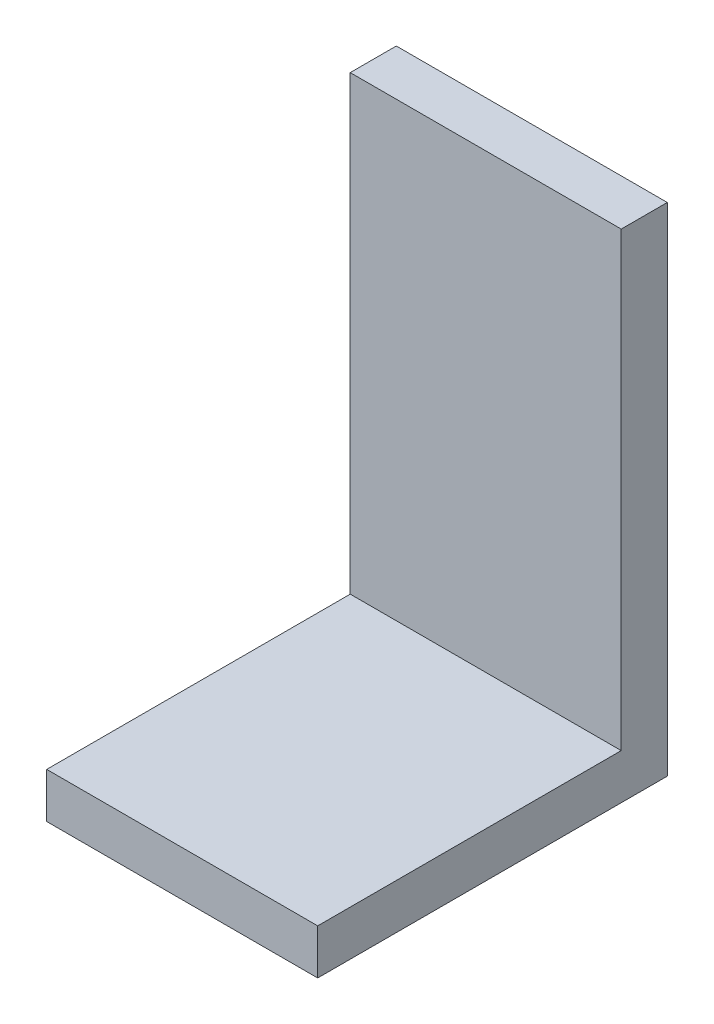
ISO-10303-21;
HEADER;
FILE_DESCRIPTION(('STEP AP214'),'2;1');
FILE_NAME('part.step','',(''),(''),'','','');
FILE_SCHEMA(('AUTOMOTIVE_DESIGN { 1 0 10303 214 1 1 1 1 }'));
ENDSEC;
DATA;
#1=APPLICATION_CONTEXT('core data for automotive mechanical design processes');
#2=APPLICATION_PROTOCOL_DEFINITION('international standard','automotive_design',2000,#1);
#3=PRODUCT_CONTEXT('',#1,'mechanical');
#4=PRODUCT('Part','Part','',(#3));
#5=PRODUCT_RELATED_PRODUCT_CATEGORY('part','',(#4));
#6=PRODUCT_DEFINITION_FORMATION('','',#4);
#7=PRODUCT_DEFINITION_CONTEXT('part definition',#1,'design');
#8=PRODUCT_DEFINITION('design','',#6,#7);
#9=PRODUCT_DEFINITION_SHAPE('','',#8);
#10=(LENGTH_UNIT() NAMED_UNIT(*) SI_UNIT(.MILLI.,.METRE.));
#11=(NAMED_UNIT(*) PLANE_ANGLE_UNIT() SI_UNIT($,.RADIAN.));
#12=(NAMED_UNIT(*) SI_UNIT($,.STERADIAN.) SOLID_ANGLE_UNIT());
#13=UNCERTAINTY_MEASURE_WITH_UNIT(LENGTH_MEASURE(1.E-05),#10,'distance_accuracy_value','');
#14=(GEOMETRIC_REPRESENTATION_CONTEXT(3) GLOBAL_UNCERTAINTY_ASSIGNED_CONTEXT((#13)) GLOBAL_UNIT_ASSIGNED_CONTEXT((#10,
#11,#12)) REPRESENTATION_CONTEXT('',''));
#15=CARTESIAN_POINT('',(0.,0.,0.));
#16=DIRECTION('',(0.,0.,1.));
#17=DIRECTION('',(1.,0.,0.));
#18=AXIS2_PLACEMENT_3D('',#15,#16,#17);
#19=CARTESIAN_POINT('',(-2.1,-4.55,0.));
#20=DIRECTION('',(1.,0.,0.));
#21=DIRECTION('',(0.,0.,1.));
#22=AXIS2_PLACEMENT_3D('',#19,#20,#21);
#23=PLANE('',#22);
#24=DIRECTION('',(0.,-1.,0.));
#25=VECTOR('',#24,1.);
#26=CARTESIAN_POINT('',(-2.1,-4.,0.));
#27=LINE('',#26,#25);
#28=CARTESIAN_POINT('',(-2.1,-4.,0.));
#29=VERTEX_POINT('',#28);
#30=CARTESIAN_POINT('',(-2.1,-4.55,0.));
#31=VERTEX_POINT('',#30);
#32=EDGE_CURVE('E11',#29,#31,#27,.T.);
#33=ORIENTED_EDGE('',*,*,#32,.F.);
#34=DIRECTION('',(0.,0.,-1.));
#35=VECTOR('',#34,1.);
#36=CARTESIAN_POINT('',(-2.1,-4.,0.051));
#37=LINE('',#36,#35);
#38=CARTESIAN_POINT('',(-2.1,-4.,0.051));
#39=VERTEX_POINT('',#38);
#40=EDGE_CURVE('E24',#39,#29,#37,.T.);
#41=ORIENTED_EDGE('',*,*,#40,.F.);
#42=DIRECTION('',(0.,1.,0.));
#43=VECTOR('',#42,1.);
#44=CARTESIAN_POINT('',(-2.1,-4.5,0.051));
#45=LINE('',#44,#43);
#46=CARTESIAN_POINT('',(-2.1,-4.5,0.051));
#47=VERTEX_POINT('',#46);
#48=EDGE_CURVE('E87',#47,#39,#45,.T.);
#49=ORIENTED_EDGE('',*,*,#48,.F.);
#50=DIRECTION('',(0.,0.,-1.));
#51=VECTOR('',#50,1.);
#52=CARTESIAN_POINT('',(-2.1,-4.5,0.387));
#53=LINE('',#52,#51);
#54=CARTESIAN_POINT('',(-2.1,-4.5,0.387));
#55=VERTEX_POINT('',#54);
#56=EDGE_CURVE('E114',#55,#47,#53,.T.);
#57=ORIENTED_EDGE('',*,*,#56,.F.);
#58=DIRECTION('',(0.,1.,0.));
#59=VECTOR('',#58,1.);
#60=CARTESIAN_POINT('',(-2.1,-4.55,0.387));
#61=LINE('',#60,#59);
#62=CARTESIAN_POINT('',(-2.1,-4.55,0.387));
#63=VERTEX_POINT('',#62);
#64=EDGE_CURVE('E111',#63,#55,#61,.T.);
#65=ORIENTED_EDGE('',*,*,#64,.F.);
#66=DIRECTION('',(0.,0.,1.));
#67=VECTOR('',#66,1.);
#68=CARTESIAN_POINT('',(-2.1,-4.55,0.));
#69=LINE('',#68,#67);
#70=EDGE_CURVE('E108',#31,#63,#69,.T.);
#71=ORIENTED_EDGE('',*,*,#70,.F.);
#72=EDGE_LOOP('',(#33,#41,#49,#57,#65,#71));
#73=FACE_BOUND('',#72,.T.);
#74=ADVANCED_FACE('F17',(#73),#23,.T.);
#75=CARTESIAN_POINT('',(-2.4,-4.,0.));
#76=DIRECTION('',(-1.,0.,0.));
#77=DIRECTION('',(0.,0.,1.));
#78=AXIS2_PLACEMENT_3D('',#75,#76,#77);
#79=PLANE('',#78);
#80=DIRECTION('',(0.,1.,0.));
#81=VECTOR('',#80,1.);
#82=CARTESIAN_POINT('',(-2.4,-4.55,0.));
#83=LINE('',#82,#81);
#84=CARTESIAN_POINT('',(-2.4,-4.55,0.));
#85=VERTEX_POINT('',#84);
#86=CARTESIAN_POINT('',(-2.4,-4.,0.));
#87=VERTEX_POINT('',#86);
#88=EDGE_CURVE('E106',#85,#87,#83,.T.);
#89=ORIENTED_EDGE('',*,*,#88,.F.);
#90=DIRECTION('',(0.,0.,-1.));
#91=VECTOR('',#90,1.);
#92=CARTESIAN_POINT('',(-2.4,-4.55,0.387));
#93=LINE('',#92,#91);
#94=CARTESIAN_POINT('',(-2.4,-4.55,0.387));
#95=VERTEX_POINT('',#94);
#96=EDGE_CURVE('E103',#95,#85,#93,.T.);
#97=ORIENTED_EDGE('',*,*,#96,.F.);
#98=DIRECTION('',(0.,-1.,0.));
#99=VECTOR('',#98,1.);
#100=CARTESIAN_POINT('',(-2.4,-4.5,0.387));
#101=LINE('',#100,#99);
#102=CARTESIAN_POINT('',(-2.4,-4.5,0.387));
#103=VERTEX_POINT('',#102);
#104=EDGE_CURVE('E100',#103,#95,#101,.T.);
#105=ORIENTED_EDGE('',*,*,#104,.F.);
#106=DIRECTION('',(0.,0.,1.));
#107=VECTOR('',#106,1.);
#108=CARTESIAN_POINT('',(-2.4,-4.5,0.051));
#109=LINE('',#108,#107);
#110=CARTESIAN_POINT('',(-2.4,-4.5,0.051));
#111=VERTEX_POINT('',#110);
#112=EDGE_CURVE('E72',#111,#103,#109,.T.);
#113=ORIENTED_EDGE('',*,*,#112,.F.);
#114=DIRECTION('',(0.,-1.,0.));
#115=VECTOR('',#114,1.);
#116=CARTESIAN_POINT('',(-2.4,-4.,0.051));
#117=LINE('',#116,#115);
#118=CARTESIAN_POINT('',(-2.4,-4.,0.051));
#119=VERTEX_POINT('',#118);
#120=EDGE_CURVE('E66',#119,#111,#117,.T.);
#121=ORIENTED_EDGE('',*,*,#120,.F.);
#122=DIRECTION('',(0.,0.,1.));
#123=VECTOR('',#122,1.);
#124=CARTESIAN_POINT('',(-2.4,-4.,0.));
#125=LINE('',#124,#123);
#126=EDGE_CURVE('E69',#87,#119,#125,.T.);
#127=ORIENTED_EDGE('',*,*,#126,.F.);
#128=EDGE_LOOP('',(#89,#97,#105,#113,#121,#127));
#129=FACE_BOUND('',#128,.T.);
#130=ADVANCED_FACE('F68',(#129),#79,.T.);
#131=CARTESIAN_POINT('',(-2.1,-4.55,0.387));
#132=DIRECTION('',(0.,0.,1.));
#133=DIRECTION('',(0.,1.,0.));
#134=AXIS2_PLACEMENT_3D('',#131,#132,#133);
#135=PLANE('',#134);
#136=ORIENTED_EDGE('',*,*,#64,.T.);
#137=DIRECTION('',(1.,0.,0.));
#138=VECTOR('',#137,1.);
#139=CARTESIAN_POINT('',(-2.4,-4.5,0.387));
#140=LINE('',#139,#138);
#141=EDGE_CURVE('E83',#103,#55,#140,.T.);
#142=ORIENTED_EDGE('',*,*,#141,.F.);
#143=ORIENTED_EDGE('',*,*,#104,.T.);
#144=DIRECTION('',(-1.,0.,0.));
#145=VECTOR('',#144,1.);
#146=CARTESIAN_POINT('',(-2.1,-4.55,0.387));
#147=LINE('',#146,#145);
#148=EDGE_CURVE('E88',#63,#95,#147,.T.);
#149=ORIENTED_EDGE('',*,*,#148,.F.);
#150=EDGE_LOOP('',(#136,#142,#143,#149));
#151=FACE_BOUND('',#150,.T.);
#152=ADVANCED_FACE('F125',(#151),#135,.T.);
#153=CARTESIAN_POINT('',(-2.1,-4.5,0.051));
#154=DIRECTION('',(0.,0.,1.));
#155=DIRECTION('',(0.,1.,0.));
#156=AXIS2_PLACEMENT_3D('',#153,#154,#155);
#157=PLANE('',#156);
#158=ORIENTED_EDGE('',*,*,#48,.T.);
#159=DIRECTION('',(1.,0.,0.));
#160=VECTOR('',#159,1.);
#161=CARTESIAN_POINT('',(-2.4,-4.,0.051));
#162=LINE('',#161,#160);
#163=EDGE_CURVE('E81',#119,#39,#162,.T.);
#164=ORIENTED_EDGE('',*,*,#163,.F.);
#165=ORIENTED_EDGE('',*,*,#120,.T.);
#166=DIRECTION('',(-1.,0.,0.));
#167=VECTOR('',#166,1.);
#168=CARTESIAN_POINT('',(-2.1,-4.5,0.051));
#169=LINE('',#168,#167);
#170=EDGE_CURVE('E89',#47,#111,#169,.T.);
#171=ORIENTED_EDGE('',*,*,#170,.F.);
#172=EDGE_LOOP('',(#158,#164,#165,#171));
#173=FACE_BOUND('',#172,.T.);
#174=ADVANCED_FACE('F86',(#173),#157,.T.);
#175=CARTESIAN_POINT('',(-2.4,-4.55,0.));
#176=DIRECTION('',(0.,-1.,0.));
#177=DIRECTION('',(0.,0.,1.));
#178=AXIS2_PLACEMENT_3D('',#175,#176,#177);
#179=PLANE('',#178);
#180=DIRECTION('',(-1.,0.,0.));
#181=VECTOR('',#180,1.);
#182=CARTESIAN_POINT('',(-2.1,-4.55,0.));
#183=LINE('',#182,#181);
#184=EDGE_CURVE('E93',#31,#85,#183,.T.);
#185=ORIENTED_EDGE('',*,*,#184,.F.);
#186=ORIENTED_EDGE('',*,*,#70,.T.);
#187=ORIENTED_EDGE('',*,*,#148,.T.);
#188=ORIENTED_EDGE('',*,*,#96,.T.);
#189=EDGE_LOOP('',(#185,#186,#187,#188));
#190=FACE_BOUND('',#189,.T.);
#191=ADVANCED_FACE('F121',(#190),#179,.T.);
#192=CARTESIAN_POINT('',(-2.1,-4.,0.));
#193=DIRECTION('',(0.,1.,0.));
#194=DIRECTION('',(0.,0.,1.));
#195=AXIS2_PLACEMENT_3D('',#192,#193,#194);
#196=PLANE('',#195);
#197=DIRECTION('',(1.,0.,0.));
#198=VECTOR('',#197,1.);
#199=CARTESIAN_POINT('',(-2.4,-4.,0.));
#200=LINE('',#199,#198);
#201=EDGE_CURVE('E82',#87,#29,#200,.T.);
#202=ORIENTED_EDGE('',*,*,#201,.F.);
#203=ORIENTED_EDGE('',*,*,#126,.T.);
#204=ORIENTED_EDGE('',*,*,#163,.T.);
#205=ORIENTED_EDGE('',*,*,#40,.T.);
#206=EDGE_LOOP('',(#202,#203,#204,#205));
#207=FACE_BOUND('',#206,.T.);
#208=ADVANCED_FACE('F80',(#207),#196,.T.);
#209=CARTESIAN_POINT('',(-2.1,-4.5,0.051));
#210=DIRECTION('',(0.,1.,0.));
#211=DIRECTION('',(0.,0.,1.));
#212=AXIS2_PLACEMENT_3D('',#209,#210,#211);
#213=PLANE('',#212);
#214=ORIENTED_EDGE('',*,*,#170,.T.);
#215=ORIENTED_EDGE('',*,*,#112,.T.);
#216=ORIENTED_EDGE('',*,*,#141,.T.);
#217=ORIENTED_EDGE('',*,*,#56,.T.);
#218=EDGE_LOOP('',(#214,#215,#216,#217));
#219=FACE_BOUND('',#218,.T.);
#220=ADVANCED_FACE('F127',(#219),#213,.T.);
#221=CARTESIAN_POINT('',(-2.4,-4.55,0.));
#222=DIRECTION('',(0.,0.,-1.));
#223=DIRECTION('',(0.,1.,0.));
#224=AXIS2_PLACEMENT_3D('',#221,#222,#223);
#225=PLANE('',#224);
#226=ORIENTED_EDGE('',*,*,#88,.T.);
#227=ORIENTED_EDGE('',*,*,#201,.T.);
#228=ORIENTED_EDGE('',*,*,#32,.T.);
#229=ORIENTED_EDGE('',*,*,#184,.T.);
#230=EDGE_LOOP('',(#226,#227,#228,#229));
#231=FACE_BOUND('',#230,.T.);
#232=ADVANCED_FACE('F117',(#231),#225,.T.);
#233=CLOSED_SHELL('',(#74,#130,#152,#174,#191,#208,#220,#232));
#234=MANIFOLD_SOLID_BREP('B1',#233);
#235=ADVANCED_BREP_SHAPE_REPRESENTATION('',(#18,#234),#14);
#236=SHAPE_DEFINITION_REPRESENTATION(#9,#235);
ENDSEC;
END-ISO-10303-21;
